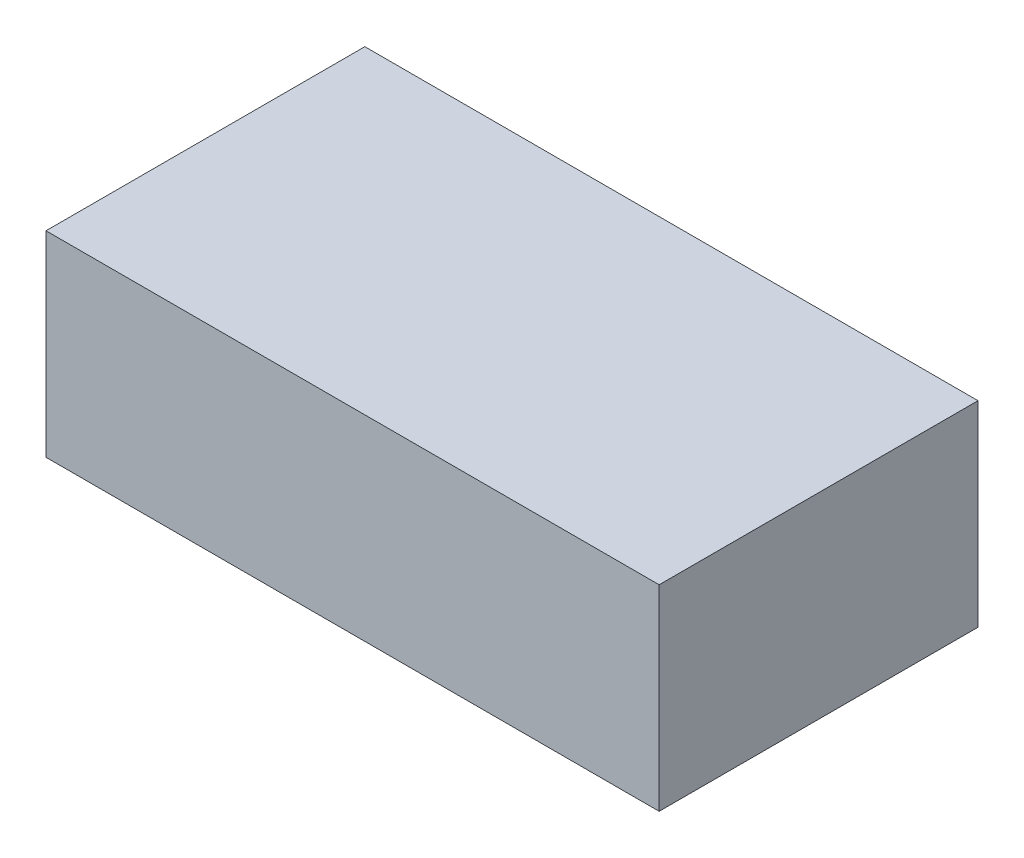
ISO-10303-21;
HEADER;
FILE_DESCRIPTION(('STEP AP214'),'2;1');
FILE_NAME('part.step','',(''),(''),'','','');
FILE_SCHEMA(('AUTOMOTIVE_DESIGN { 1 0 10303 214 1 1 1 1 }'));
ENDSEC;
DATA;
#1=APPLICATION_CONTEXT('core data for automotive mechanical design processes');
#2=APPLICATION_PROTOCOL_DEFINITION('international standard','automotive_design',2000,#1);
#3=PRODUCT_CONTEXT('',#1,'mechanical');
#4=PRODUCT('Part','Part','',(#3));
#5=PRODUCT_RELATED_PRODUCT_CATEGORY('part','',(#4));
#6=PRODUCT_DEFINITION_FORMATION('','',#4);
#7=PRODUCT_DEFINITION_CONTEXT('part definition',#1,'design');
#8=PRODUCT_DEFINITION('design','',#6,#7);
#9=PRODUCT_DEFINITION_SHAPE('','',#8);
#10=(LENGTH_UNIT() NAMED_UNIT(*) SI_UNIT(.MILLI.,.METRE.));
#11=(NAMED_UNIT(*) PLANE_ANGLE_UNIT() SI_UNIT($,.RADIAN.));
#12=(NAMED_UNIT(*) SI_UNIT($,.STERADIAN.) SOLID_ANGLE_UNIT());
#13=UNCERTAINTY_MEASURE_WITH_UNIT(LENGTH_MEASURE(1.E-05),#10,'distance_accuracy_value','');
#14=(GEOMETRIC_REPRESENTATION_CONTEXT(3) GLOBAL_UNCERTAINTY_ASSIGNED_CONTEXT((#13)) GLOBAL_UNIT_ASSIGNED_CONTEXT((#10,
#11,#12)) REPRESENTATION_CONTEXT('',''));
#15=CARTESIAN_POINT('',(0.,0.,0.));
#16=DIRECTION('',(0.,0.,1.));
#17=DIRECTION('',(1.,0.,0.));
#18=AXIS2_PLACEMENT_3D('',#15,#16,#17);
#19=CARTESIAN_POINT('',(0.635,0.2032,0.));
#20=DIRECTION('',(0.,-1.,0.));
#21=DIRECTION('',(0.,0.,-1.));
#22=AXIS2_PLACEMENT_3D('',#19,#20,#21);
#23=PLANE('',#22);
#24=DIRECTION('',(0.,0.,-1.));
#25=VECTOR('',#24,1.);
#26=CARTESIAN_POINT('',(-0.635,0.2032,0.));
#27=LINE('',#26,#25);
#28=CARTESIAN_POINT('',(-0.635,0.2032,0.));
#29=VERTEX_POINT('',#28);
#30=CARTESIAN_POINT('',(-0.635,0.2032,0.6604));
#31=VERTEX_POINT('',#30);
#32=EDGE_CURVE('E20',#29,#31,#27,.F.);
#33=ORIENTED_EDGE('',*,*,#32,.T.);
#34=DIRECTION('',(-1.,0.,0.));
#35=VECTOR('',#34,1.);
#36=CARTESIAN_POINT('',(-0.635,0.2032,0.6604));
#37=LINE('',#36,#35);
#38=CARTESIAN_POINT('',(0.635,0.2032,0.6604));
#39=VERTEX_POINT('',#38);
#40=EDGE_CURVE('E55',#31,#39,#37,.F.);
#41=ORIENTED_EDGE('',*,*,#40,.T.);
#42=DIRECTION('',(0.,0.,1.));
#43=VECTOR('',#42,1.);
#44=CARTESIAN_POINT('',(0.635,0.2032,0.));
#45=LINE('',#44,#43);
#46=CARTESIAN_POINT('',(0.635,0.2032,0.));
#47=VERTEX_POINT('',#46);
#48=EDGE_CURVE('E74',#39,#47,#45,.F.);
#49=ORIENTED_EDGE('',*,*,#48,.T.);
#50=DIRECTION('',(-1.,0.,0.));
#51=VECTOR('',#50,1.);
#52=CARTESIAN_POINT('',(-0.635,0.2032,0.));
#53=LINE('',#52,#51);
#54=EDGE_CURVE('E66',#29,#47,#53,.F.);
#55=ORIENTED_EDGE('',*,*,#54,.F.);
#56=EDGE_LOOP('',(#33,#41,#49,#55));
#57=FACE_BOUND('',#56,.T.);
#58=ADVANCED_FACE('F17',(#57),#23,.F.);
#59=CARTESIAN_POINT('',(-0.635,0.2032,0.));
#60=DIRECTION('',(1.,0.,0.));
#61=DIRECTION('',(0.,0.,-1.));
#62=AXIS2_PLACEMENT_3D('',#59,#60,#61);
#63=PLANE('',#62);
#64=DIRECTION('',(0.,0.,1.));
#65=VECTOR('',#64,1.);
#66=CARTESIAN_POINT('',(-0.635,-0.2032,0.));
#67=LINE('',#66,#65);
#68=CARTESIAN_POINT('',(-0.635,-0.2032,0.));
#69=VERTEX_POINT('',#68);
#70=CARTESIAN_POINT('',(-0.635,-0.2032,0.6604));
#71=VERTEX_POINT('',#70);
#72=EDGE_CURVE('E72',#69,#71,#67,.T.);
#73=ORIENTED_EDGE('',*,*,#72,.T.);
#74=DIRECTION('',(0.,1.,0.));
#75=VECTOR('',#74,1.);
#76=CARTESIAN_POINT('',(-0.635,0.2032,0.6604));
#77=LINE('',#76,#75);
#78=EDGE_CURVE('E62',#71,#31,#77,.T.);
#79=ORIENTED_EDGE('',*,*,#78,.T.);
#80=ORIENTED_EDGE('',*,*,#32,.F.);
#81=DIRECTION('',(0.,1.,0.));
#82=VECTOR('',#81,1.);
#83=CARTESIAN_POINT('',(-0.635,0.2032,0.));
#84=LINE('',#83,#82);
#85=EDGE_CURVE('E80',#69,#29,#84,.T.);
#86=ORIENTED_EDGE('',*,*,#85,.F.);
#87=EDGE_LOOP('',(#73,#79,#80,#86));
#88=FACE_BOUND('',#87,.T.);
#89=ADVANCED_FACE('F71',(#88),#63,.F.);
#90=CARTESIAN_POINT('',(-0.635,0.2032,0.6604));
#91=DIRECTION('',(0.,0.,-1.));
#92=DIRECTION('',(-1.,0.,0.));
#93=AXIS2_PLACEMENT_3D('',#90,#91,#92);
#94=PLANE('',#93);
#95=DIRECTION('',(1.,0.,0.));
#96=VECTOR('',#95,1.);
#97=CARTESIAN_POINT('',(-0.635,-0.2032,0.6604));
#98=LINE('',#97,#96);
#99=CARTESIAN_POINT('',(0.635,-0.2032,0.6604));
#100=VERTEX_POINT('',#99);
#101=EDGE_CURVE('E83',#71,#100,#98,.T.);
#102=ORIENTED_EDGE('',*,*,#101,.T.);
#103=DIRECTION('',(0.,1.,0.));
#104=VECTOR('',#103,1.);
#105=CARTESIAN_POINT('',(0.635,-0.2032,0.6604));
#106=LINE('',#105,#104);
#107=EDGE_CURVE('E64',#100,#39,#106,.T.);
#108=ORIENTED_EDGE('',*,*,#107,.T.);
#109=ORIENTED_EDGE('',*,*,#40,.F.);
#110=ORIENTED_EDGE('',*,*,#78,.F.);
#111=EDGE_LOOP('',(#102,#108,#109,#110));
#112=FACE_BOUND('',#111,.T.);
#113=ADVANCED_FACE('F60',(#112),#94,.F.);
#114=CARTESIAN_POINT('',(0.635,-0.2032,0.));
#115=DIRECTION('',(-1.,0.,0.));
#116=DIRECTION('',(0.,0.,1.));
#117=AXIS2_PLACEMENT_3D('',#114,#115,#116);
#118=PLANE('',#117);
#119=ORIENTED_EDGE('',*,*,#48,.F.);
#120=ORIENTED_EDGE('',*,*,#107,.F.);
#121=DIRECTION('',(0.,0.,1.));
#122=VECTOR('',#121,1.);
#123=CARTESIAN_POINT('',(0.635,-0.2032,0.));
#124=LINE('',#123,#122);
#125=CARTESIAN_POINT('',(0.635,-0.2032,0.));
#126=VERTEX_POINT('',#125);
#127=EDGE_CURVE('E26',#100,#126,#124,.F.);
#128=ORIENTED_EDGE('',*,*,#127,.T.);
#129=DIRECTION('',(0.,1.,0.));
#130=VECTOR('',#129,1.);
#131=CARTESIAN_POINT('',(0.635,0.2032,0.));
#132=LINE('',#131,#130);
#133=EDGE_CURVE('E34',#47,#126,#132,.F.);
#134=ORIENTED_EDGE('',*,*,#133,.F.);
#135=EDGE_LOOP('',(#119,#120,#128,#134));
#136=FACE_BOUND('',#135,.T.);
#137=ADVANCED_FACE('F88',(#136),#118,.F.);
#138=CARTESIAN_POINT('',(-0.635,0.2032,0.));
#139=DIRECTION('',(0.,0.,-1.));
#140=DIRECTION('',(-1.,0.,0.));
#141=AXIS2_PLACEMENT_3D('',#138,#139,#140);
#142=PLANE('',#141);
#143=DIRECTION('',(1.,0.,0.));
#144=VECTOR('',#143,1.);
#145=CARTESIAN_POINT('',(-0.635,-0.2032,0.));
#146=LINE('',#145,#144);
#147=EDGE_CURVE('E11',#126,#69,#146,.F.);
#148=ORIENTED_EDGE('',*,*,#147,.T.);
#149=ORIENTED_EDGE('',*,*,#85,.T.);
#150=ORIENTED_EDGE('',*,*,#54,.T.);
#151=ORIENTED_EDGE('',*,*,#133,.T.);
#152=EDGE_LOOP('',(#148,#149,#150,#151));
#153=FACE_BOUND('',#152,.T.);
#154=ADVANCED_FACE('F91',(#153),#142,.T.);
#155=CARTESIAN_POINT('',(-0.635,-0.2032,0.));
#156=DIRECTION('',(0.,1.,0.));
#157=DIRECTION('',(0.,0.,1.));
#158=AXIS2_PLACEMENT_3D('',#155,#156,#157);
#159=PLANE('',#158);
#160=ORIENTED_EDGE('',*,*,#127,.F.);
#161=ORIENTED_EDGE('',*,*,#101,.F.);
#162=ORIENTED_EDGE('',*,*,#72,.F.);
#163=ORIENTED_EDGE('',*,*,#147,.F.);
#164=EDGE_LOOP('',(#160,#161,#162,#163));
#165=FACE_BOUND('',#164,.T.);
#166=ADVANCED_FACE('F90',(#165),#159,.F.);
#167=CLOSED_SHELL('',(#58,#89,#113,#137,#154,#166));
#168=MANIFOLD_SOLID_BREP('B1',#167);
#169=ADVANCED_BREP_SHAPE_REPRESENTATION('',(#18,#168),#14);
#170=SHAPE_DEFINITION_REPRESENTATION(#9,#169);
ENDSEC;
END-ISO-10303-21;
